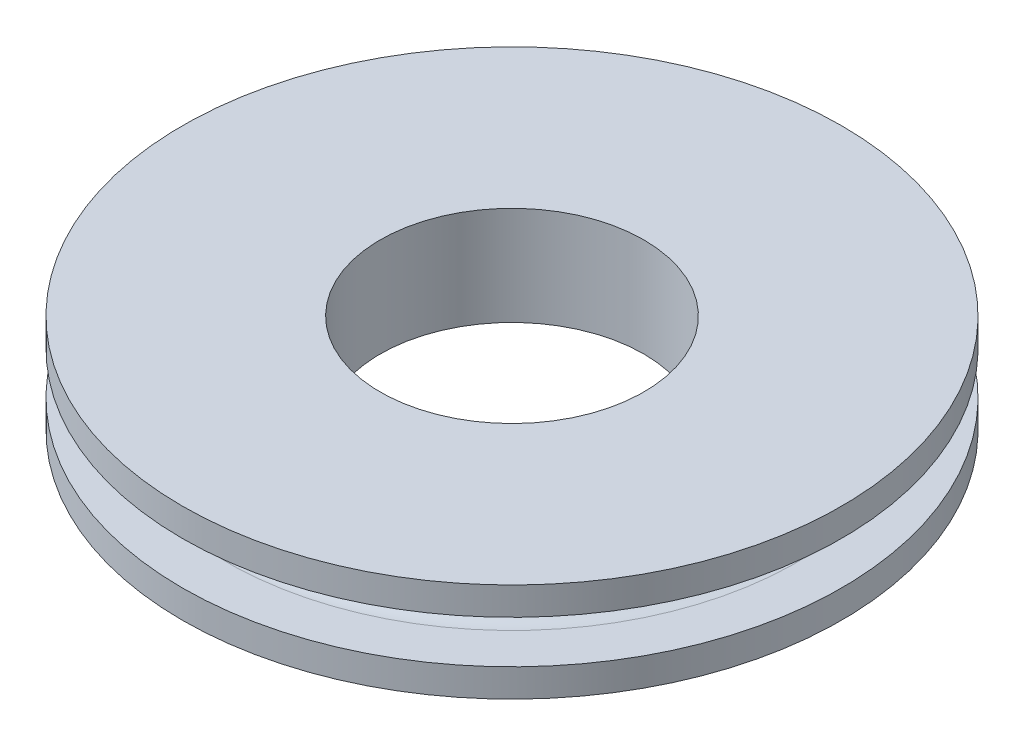
ISO-10303-21;
HEADER;
FILE_DESCRIPTION(('STEP AP214'),'2;1');
FILE_NAME('part.step','',(''),(''),'','','');
FILE_SCHEMA(('AUTOMOTIVE_DESIGN { 1 0 10303 214 1 1 1 1 }'));
ENDSEC;
DATA;
#1=APPLICATION_CONTEXT('core data for automotive mechanical design processes');
#2=APPLICATION_PROTOCOL_DEFINITION('international standard','automotive_design',2000,#1);
#3=PRODUCT_CONTEXT('',#1,'mechanical');
#4=PRODUCT('Part','Part','',(#3));
#5=PRODUCT_RELATED_PRODUCT_CATEGORY('part','',(#4));
#6=PRODUCT_DEFINITION_FORMATION('','',#4);
#7=PRODUCT_DEFINITION_CONTEXT('part definition',#1,'design');
#8=PRODUCT_DEFINITION('design','',#6,#7);
#9=PRODUCT_DEFINITION_SHAPE('','',#8);
#10=(LENGTH_UNIT() NAMED_UNIT(*) SI_UNIT(.MILLI.,.METRE.));
#11=(NAMED_UNIT(*) PLANE_ANGLE_UNIT() SI_UNIT($,.RADIAN.));
#12=(NAMED_UNIT(*) SI_UNIT($,.STERADIAN.) SOLID_ANGLE_UNIT());
#13=UNCERTAINTY_MEASURE_WITH_UNIT(LENGTH_MEASURE(1.E-05),#10,'distance_accuracy_value','');
#14=(GEOMETRIC_REPRESENTATION_CONTEXT(3) GLOBAL_UNCERTAINTY_ASSIGNED_CONTEXT((#13)) GLOBAL_UNIT_ASSIGNED_CONTEXT((#10,
#11,#12)) REPRESENTATION_CONTEXT('',''));
#15=CARTESIAN_POINT('',(0.,0.,0.));
#16=DIRECTION('',(0.,0.,1.));
#17=DIRECTION('',(1.,0.,0.));
#18=AXIS2_PLACEMENT_3D('',#15,#16,#17);
#19=CARTESIAN_POINT('',(4.,1.5,0.));
#20=DIRECTION('',(0.,1.,0.));
#21=DIRECTION('',(0.,0.,1.));
#22=AXIS2_PLACEMENT_3D('',#19,#20,#21);
#23=PLANE('',#22);
#24=CARTESIAN_POINT('',(0.,1.5,0.));
#25=DIRECTION('',(0.,-1.,0.));
#26=DIRECTION('',(0.,0.,-1.));
#27=AXIS2_PLACEMENT_3D('',#24,#25,#26);
#28=CIRCLE('',#27,4.);
#29=CARTESIAN_POINT('',(0.,1.5,-4.));
#30=VERTEX_POINT('',#29);
#31=EDGE_CURVE('E10',#30,#30,#28,.T.);
#32=ORIENTED_EDGE('',*,*,#31,.T.);
#33=EDGE_LOOP('',(#32));
#34=FACE_BOUND('',#33,.T.);
#35=CARTESIAN_POINT('',(0.,1.5,0.));
#36=DIRECTION('',(0.,-1.,0.));
#37=DIRECTION('',(0.,0.,-1.));
#38=AXIS2_PLACEMENT_3D('',#35,#36,#37);
#39=CIRCLE('',#38,10.);
#40=CARTESIAN_POINT('',(0.,1.5,-10.));
#41=VERTEX_POINT('',#40);
#42=EDGE_CURVE('E78',#41,#41,#39,.T.);
#43=ORIENTED_EDGE('',*,*,#42,.F.);
#44=EDGE_LOOP('',(#43));
#45=FACE_BOUND('',#44,.T.);
#46=ADVANCED_FACE('F43',(#34,#45),#23,.T.);
#47=CARTESIAN_POINT('',(0.,-1.5,0.));
#48=DIRECTION('',(0.,-1.,0.));
#49=DIRECTION('',(0.,0.,-1.));
#50=AXIS2_PLACEMENT_3D('',#47,#48,#49);
#51=CYLINDRICAL_SURFACE('',#50,4.);
#52=CARTESIAN_POINT('',(0.,-1.5,0.));
#53=DIRECTION('',(0.,-1.,0.));
#54=DIRECTION('',(0.,0.,-1.));
#55=AXIS2_PLACEMENT_3D('',#52,#53,#54);
#56=CIRCLE('',#55,4.);
#57=CARTESIAN_POINT('',(0.,-1.5,-4.));
#58=VERTEX_POINT('',#57);
#59=EDGE_CURVE('E50',#58,#58,#56,.T.);
#60=ORIENTED_EDGE('',*,*,#59,.T.);
#61=EDGE_LOOP('',(#60));
#62=FACE_BOUND('',#61,.T.);
#63=ORIENTED_EDGE('',*,*,#31,.F.);
#64=EDGE_LOOP('',(#63));
#65=FACE_BOUND('',#64,.T.);
#66=ADVANCED_FACE('F87',(#62,#65),#51,.F.);
#67=CARTESIAN_POINT('',(10.,-1.5,0.));
#68=DIRECTION('',(0.,-1.,0.));
#69=DIRECTION('',(0.,0.,-1.));
#70=AXIS2_PLACEMENT_3D('',#67,#68,#69);
#71=PLANE('',#70);
#72=CARTESIAN_POINT('',(0.,-1.5,0.));
#73=DIRECTION('',(0.,-1.,0.));
#74=DIRECTION('',(0.,0.,-1.));
#75=AXIS2_PLACEMENT_3D('',#72,#73,#74);
#76=CIRCLE('',#75,10.);
#77=CARTESIAN_POINT('',(0.,-1.5,-10.));
#78=VERTEX_POINT('',#77);
#79=EDGE_CURVE('E55',#78,#78,#76,.T.);
#80=ORIENTED_EDGE('',*,*,#79,.T.);
#81=EDGE_LOOP('',(#80));
#82=FACE_BOUND('',#81,.T.);
#83=ORIENTED_EDGE('',*,*,#59,.F.);
#84=EDGE_LOOP('',(#83));
#85=FACE_BOUND('',#84,.T.);
#86=ADVANCED_FACE('F91',(#82,#85),#71,.T.);
#87=CARTESIAN_POINT('',(0.,-1.5,0.));
#88=DIRECTION('',(0.,-1.,0.));
#89=DIRECTION('',(0.,0.,-1.));
#90=AXIS2_PLACEMENT_3D('',#87,#88,#89);
#91=CYLINDRICAL_SURFACE('',#90,10.);
#92=CARTESIAN_POINT('',(0.,-0.65,0.));
#93=DIRECTION('',(0.,-1.,0.));
#94=DIRECTION('',(0.,0.,-1.));
#95=AXIS2_PLACEMENT_3D('',#92,#93,#94);
#96=CIRCLE('',#95,10.);
#97=CARTESIAN_POINT('',(0.,-0.65,-10.));
#98=VERTEX_POINT('',#97);
#99=EDGE_CURVE('E60',#98,#98,#96,.T.);
#100=ORIENTED_EDGE('',*,*,#99,.T.);
#101=EDGE_LOOP('',(#100));
#102=FACE_BOUND('',#101,.T.);
#103=ORIENTED_EDGE('',*,*,#79,.F.);
#104=EDGE_LOOP('',(#103));
#105=FACE_BOUND('',#104,.T.);
#106=ADVANCED_FACE('F95',(#102,#105),#91,.T.);
#107=CARTESIAN_POINT('',(8.65,-0.65,0.));
#108=DIRECTION('',(0.,1.,0.));
#109=DIRECTION('',(0.,0.,1.));
#110=AXIS2_PLACEMENT_3D('',#107,#108,#109);
#111=PLANE('',#110);
#112=CARTESIAN_POINT('',(0.,-0.65,0.));
#113=DIRECTION('',(0.,-1.,0.));
#114=DIRECTION('',(0.,0.,-1.));
#115=AXIS2_PLACEMENT_3D('',#112,#113,#114);
#116=CIRCLE('',#115,8.65);
#117=CARTESIAN_POINT('',(0.,-0.65,-8.65));
#118=VERTEX_POINT('',#117);
#119=EDGE_CURVE('E66',#118,#118,#116,.T.);
#120=ORIENTED_EDGE('',*,*,#119,.T.);
#121=EDGE_LOOP('',(#120));
#122=FACE_BOUND('',#121,.T.);
#123=ORIENTED_EDGE('',*,*,#99,.F.);
#124=EDGE_LOOP('',(#123));
#125=FACE_BOUND('',#124,.T.);
#126=ADVANCED_FACE('F102',(#122,#125),#111,.T.);
#127=CARTESIAN_POINT('',(0.,0.,0.));
#128=DIRECTION('',(0.,-1.,0.));
#129=DIRECTION('',(0.,0.,-1.));
#130=AXIS2_PLACEMENT_3D('',#127,#128,#129);
#131=TOROIDAL_SURFACE('',#130,8.65,0.65);
#132=CARTESIAN_POINT('',(0.,0.65,0.));
#133=DIRECTION('',(0.,-1.,0.));
#134=DIRECTION('',(0.,0.,-1.));
#135=AXIS2_PLACEMENT_3D('',#132,#133,#134);
#136=CIRCLE('',#135,8.65);
#137=CARTESIAN_POINT('',(0.,0.65,-8.65));
#138=VERTEX_POINT('',#137);
#139=EDGE_CURVE('E70',#138,#138,#136,.T.);
#140=ORIENTED_EDGE('',*,*,#139,.T.);
#141=EDGE_LOOP('',(#140));
#142=FACE_BOUND('',#141,.T.);
#143=ORIENTED_EDGE('',*,*,#119,.F.);
#144=EDGE_LOOP('',(#143));
#145=FACE_BOUND('',#144,.T.);
#146=ADVANCED_FACE('F106',(#142,#145),#131,.F.);
#147=CARTESIAN_POINT('',(10.,0.65,0.));
#148=DIRECTION('',(0.,-1.,0.));
#149=DIRECTION('',(0.,0.,-1.));
#150=AXIS2_PLACEMENT_3D('',#147,#148,#149);
#151=PLANE('',#150);
#152=CARTESIAN_POINT('',(0.,0.65,0.));
#153=DIRECTION('',(0.,-1.,0.));
#154=DIRECTION('',(0.,0.,-1.));
#155=AXIS2_PLACEMENT_3D('',#152,#153,#154);
#156=CIRCLE('',#155,10.);
#157=CARTESIAN_POINT('',(0.,0.65,-10.));
#158=VERTEX_POINT('',#157);
#159=EDGE_CURVE('E74',#158,#158,#156,.T.);
#160=ORIENTED_EDGE('',*,*,#159,.T.);
#161=EDGE_LOOP('',(#160));
#162=FACE_BOUND('',#161,.T.);
#163=ORIENTED_EDGE('',*,*,#139,.F.);
#164=EDGE_LOOP('',(#163));
#165=FACE_BOUND('',#164,.T.);
#166=ADVANCED_FACE('F110',(#162,#165),#151,.T.);
#167=CARTESIAN_POINT('',(0.,-1.5,0.));
#168=DIRECTION('',(0.,-1.,0.));
#169=DIRECTION('',(0.,0.,-1.));
#170=AXIS2_PLACEMENT_3D('',#167,#168,#169);
#171=CYLINDRICAL_SURFACE('',#170,10.);
#172=ORIENTED_EDGE('',*,*,#42,.T.);
#173=EDGE_LOOP('',(#172));
#174=FACE_BOUND('',#173,.T.);
#175=ORIENTED_EDGE('',*,*,#159,.F.);
#176=EDGE_LOOP('',(#175));
#177=FACE_BOUND('',#176,.T.);
#178=ADVANCED_FACE('F83',(#174,#177),#171,.T.);
#179=CLOSED_SHELL('',(#46,#66,#86,#106,#126,#146,#166,#178));
#180=MANIFOLD_SOLID_BREP('B2',#179);
#181=ADVANCED_BREP_SHAPE_REPRESENTATION('',(#18,#180),#14);
#182=SHAPE_DEFINITION_REPRESENTATION(#9,#181);
ENDSEC;
END-ISO-10303-21;
